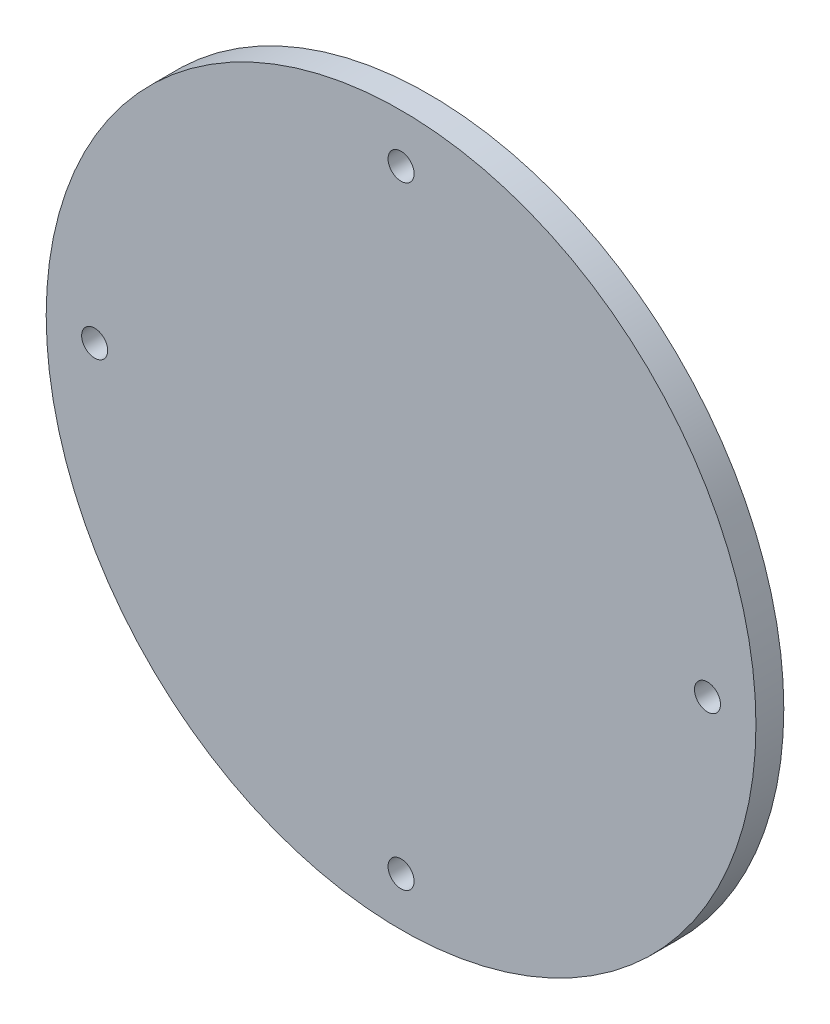
ISO-10303-21;
HEADER;
FILE_DESCRIPTION(('STEP AP214'),'2;1');
FILE_NAME('part.step','',(''),(''),'','','');
FILE_SCHEMA(('AUTOMOTIVE_DESIGN { 1 0 10303 214 1 1 1 1 }'));
ENDSEC;
DATA;
#1=APPLICATION_CONTEXT('core data for automotive mechanical design processes');
#2=APPLICATION_PROTOCOL_DEFINITION('international standard','automotive_design',2000,#1);
#3=PRODUCT_CONTEXT('',#1,'mechanical');
#4=PRODUCT('Part','Part','',(#3));
#5=PRODUCT_RELATED_PRODUCT_CATEGORY('part','',(#4));
#6=PRODUCT_DEFINITION_FORMATION('','',#4);
#7=PRODUCT_DEFINITION_CONTEXT('part definition',#1,'design');
#8=PRODUCT_DEFINITION('design','',#6,#7);
#9=PRODUCT_DEFINITION_SHAPE('','',#8);
#10=(LENGTH_UNIT() NAMED_UNIT(*) SI_UNIT(.MILLI.,.METRE.));
#11=(NAMED_UNIT(*) PLANE_ANGLE_UNIT() SI_UNIT($,.RADIAN.));
#12=(NAMED_UNIT(*) SI_UNIT($,.STERADIAN.) SOLID_ANGLE_UNIT());
#13=UNCERTAINTY_MEASURE_WITH_UNIT(LENGTH_MEASURE(1.E-05),#10,'distance_accuracy_value','');
#14=(GEOMETRIC_REPRESENTATION_CONTEXT(3) GLOBAL_UNCERTAINTY_ASSIGNED_CONTEXT((#13)) GLOBAL_UNIT_ASSIGNED_CONTEXT((#10,
#11,#12)) REPRESENTATION_CONTEXT('',''));
#15=CARTESIAN_POINT('',(0.,0.,0.));
#16=DIRECTION('',(0.,0.,1.));
#17=DIRECTION('',(1.,0.,0.));
#18=AXIS2_PLACEMENT_3D('',#15,#16,#17);
#19=CARTESIAN_POINT('',(0.,0.,5.));
#20=DIRECTION('',(0.,0.,1.));
#21=DIRECTION('',(1.,0.,0.));
#22=AXIS2_PLACEMENT_3D('',#19,#20,#21);
#23=PLANE('',#22);
#24=CARTESIAN_POINT('',(3.10618136515851E-12,-55.,5.));
#25=DIRECTION('',(0.,0.,1.));
#26=DIRECTION('',(1.,0.,0.));
#27=AXIS2_PLACEMENT_3D('',#24,#25,#26);
#28=CIRCLE('',#27,2.33568157311923);
#29=CARTESIAN_POINT('',(2.33568157312233,-55.,5.));
#30=VERTEX_POINT('',#29);
#31=EDGE_CURVE('E68',#30,#30,#28,.T.);
#32=ORIENTED_EDGE('',*,*,#31,.F.);
#33=EDGE_LOOP('',(#32));
#34=FACE_BOUND('',#33,.T.);
#35=CARTESIAN_POINT('',(0.,55.,5.));
#36=DIRECTION('',(0.,0.,1.));
#37=DIRECTION('',(1.,0.,0.));
#38=AXIS2_PLACEMENT_3D('',#35,#36,#37);
#39=CIRCLE('',#38,2.33568157311589);
#40=CARTESIAN_POINT('',(2.33568157311589,55.,5.));
#41=VERTEX_POINT('',#40);
#42=EDGE_CURVE('E54',#41,#41,#39,.T.);
#43=ORIENTED_EDGE('',*,*,#42,.F.);
#44=EDGE_LOOP('',(#43));
#45=FACE_BOUND('',#44,.T.);
#46=CARTESIAN_POINT('',(0.,0.,5.));
#47=DIRECTION('',(0.,0.,1.));
#48=DIRECTION('',(1.,0.,0.));
#49=AXIS2_PLACEMENT_3D('',#46,#47,#48);
#50=CIRCLE('',#49,63.7004065395242);
#51=CARTESIAN_POINT('',(63.7004065395242,0.,5.));
#52=VERTEX_POINT('',#51);
#53=EDGE_CURVE('E10',#52,#52,#50,.T.);
#54=ORIENTED_EDGE('',*,*,#53,.T.);
#55=EDGE_LOOP('',(#54));
#56=FACE_BOUND('',#55,.T.);
#57=CARTESIAN_POINT('',(55.0000000000016,1.55309068257925E-12,5.));
#58=DIRECTION('',(0.,0.,1.));
#59=DIRECTION('',(1.,0.,0.));
#60=AXIS2_PLACEMENT_3D('',#57,#58,#59);
#61=CIRCLE('',#60,2.3356815731171);
#62=CARTESIAN_POINT('',(57.3356815731187,1.55309068257925E-12,5.));
#63=VERTEX_POINT('',#62);
#64=EDGE_CURVE('E60',#63,#63,#61,.T.);
#65=ORIENTED_EDGE('',*,*,#64,.F.);
#66=EDGE_LOOP('',(#65));
#67=FACE_BOUND('',#66,.T.);
#68=CARTESIAN_POINT('',(-54.9999999999985,-1.55982623997457E-12,5.));
#69=DIRECTION('',(0.,0.,1.));
#70=DIRECTION('',(1.,0.,0.));
#71=AXIS2_PLACEMENT_3D('',#68,#69,#70);
#72=CIRCLE('',#71,2.33568157311839);
#73=CARTESIAN_POINT('',(-52.6643184268801,-1.55982623997457E-12,5.));
#74=VERTEX_POINT('',#73);
#75=EDGE_CURVE('E76',#74,#74,#72,.T.);
#76=ORIENTED_EDGE('',*,*,#75,.F.);
#77=EDGE_LOOP('',(#76));
#78=FACE_BOUND('',#77,.T.);
#79=ADVANCED_FACE('F41',(#34,#45,#56,#67,#78),#23,.T.);
#80=CARTESIAN_POINT('',(0.,0.,0.));
#81=DIRECTION('',(0.,0.,1.));
#82=DIRECTION('',(1.,0.,0.));
#83=AXIS2_PLACEMENT_3D('',#80,#81,#82);
#84=PLANE('',#83);
#85=CARTESIAN_POINT('',(0.,0.,0.));
#86=DIRECTION('',(0.,0.,1.));
#87=DIRECTION('',(1.,0.,0.));
#88=AXIS2_PLACEMENT_3D('',#85,#86,#87);
#89=CIRCLE('',#88,63.7004065395242);
#90=CARTESIAN_POINT('',(63.7004065395242,0.,0.));
#91=VERTEX_POINT('',#90);
#92=EDGE_CURVE('E45',#91,#91,#89,.T.);
#93=ORIENTED_EDGE('',*,*,#92,.F.);
#94=EDGE_LOOP('',(#93));
#95=FACE_BOUND('',#94,.T.);
#96=CARTESIAN_POINT('',(0.,55.,0.));
#97=DIRECTION('',(0.,0.,1.));
#98=DIRECTION('',(1.,0.,0.));
#99=AXIS2_PLACEMENT_3D('',#96,#97,#98);
#100=CIRCLE('',#99,2.33568157311589);
#101=CARTESIAN_POINT('',(2.33568157311589,55.,0.));
#102=VERTEX_POINT('',#101);
#103=EDGE_CURVE('E56',#102,#102,#100,.T.);
#104=ORIENTED_EDGE('',*,*,#103,.T.);
#105=EDGE_LOOP('',(#104));
#106=FACE_BOUND('',#105,.T.);
#107=CARTESIAN_POINT('',(55.0000000000016,1.55309068257925E-12,0.));
#108=DIRECTION('',(0.,0.,1.));
#109=DIRECTION('',(1.,0.,0.));
#110=AXIS2_PLACEMENT_3D('',#107,#108,#109);
#111=CIRCLE('',#110,2.3356815731171);
#112=CARTESIAN_POINT('',(57.3356815731187,1.55309068257925E-12,0.));
#113=VERTEX_POINT('',#112);
#114=EDGE_CURVE('E64',#113,#113,#111,.T.);
#115=ORIENTED_EDGE('',*,*,#114,.T.);
#116=EDGE_LOOP('',(#115));
#117=FACE_BOUND('',#116,.T.);
#118=CARTESIAN_POINT('',(3.10618136515851E-12,-55.,0.));
#119=DIRECTION('',(0.,0.,1.));
#120=DIRECTION('',(1.,0.,0.));
#121=AXIS2_PLACEMENT_3D('',#118,#119,#120);
#122=CIRCLE('',#121,2.33568157311923);
#123=CARTESIAN_POINT('',(2.33568157312233,-55.,0.));
#124=VERTEX_POINT('',#123);
#125=EDGE_CURVE('E72',#124,#124,#122,.T.);
#126=ORIENTED_EDGE('',*,*,#125,.T.);
#127=EDGE_LOOP('',(#126));
#128=FACE_BOUND('',#127,.T.);
#129=CARTESIAN_POINT('',(-54.9999999999985,-1.55982623997457E-12,0.));
#130=DIRECTION('',(0.,0.,1.));
#131=DIRECTION('',(1.,0.,0.));
#132=AXIS2_PLACEMENT_3D('',#129,#130,#131);
#133=CIRCLE('',#132,2.33568157311839);
#134=CARTESIAN_POINT('',(-52.6643184268801,-1.55982623997457E-12,0.));
#135=VERTEX_POINT('',#134);
#136=EDGE_CURVE('E80',#135,#135,#133,.T.);
#137=ORIENTED_EDGE('',*,*,#136,.T.);
#138=EDGE_LOOP('',(#137));
#139=FACE_BOUND('',#138,.T.);
#140=ADVANCED_FACE('F92',(#95,#106,#117,#128,#139),#84,.F.);
#141=CARTESIAN_POINT('',(0.,0.,5.));
#142=DIRECTION('',(0.,0.,-1.));
#143=DIRECTION('',(-1.,0.,0.));
#144=AXIS2_PLACEMENT_3D('',#141,#142,#143);
#145=CYLINDRICAL_SURFACE('',#144,63.7004065395242);
#146=ORIENTED_EDGE('',*,*,#53,.F.);
#147=EDGE_LOOP('',(#146));
#148=FACE_BOUND('',#147,.T.);
#149=ORIENTED_EDGE('',*,*,#92,.T.);
#150=EDGE_LOOP('',(#149));
#151=FACE_BOUND('',#150,.T.);
#152=ADVANCED_FACE('F43',(#148,#151),#145,.T.);
#153=CARTESIAN_POINT('',(0.,55.,5.));
#154=DIRECTION('',(0.,0.,-1.));
#155=DIRECTION('',(-1.,0.,0.));
#156=AXIS2_PLACEMENT_3D('',#153,#154,#155);
#157=CYLINDRICAL_SURFACE('',#156,2.33568157311589);
#158=ORIENTED_EDGE('',*,*,#42,.T.);
#159=EDGE_LOOP('',(#158));
#160=FACE_BOUND('',#159,.T.);
#161=ORIENTED_EDGE('',*,*,#103,.F.);
#162=EDGE_LOOP('',(#161));
#163=FACE_BOUND('',#162,.T.);
#164=ADVANCED_FACE('F102',(#160,#163),#157,.F.);
#165=CARTESIAN_POINT('',(55.0000000000016,1.55309068257925E-12,5.));
#166=DIRECTION('',(0.,0.,-1.));
#167=DIRECTION('',(-1.,0.,0.));
#168=AXIS2_PLACEMENT_3D('',#165,#166,#167);
#169=CYLINDRICAL_SURFACE('',#168,2.3356815731171);
#170=ORIENTED_EDGE('',*,*,#64,.T.);
#171=EDGE_LOOP('',(#170));
#172=FACE_BOUND('',#171,.T.);
#173=ORIENTED_EDGE('',*,*,#114,.F.);
#174=EDGE_LOOP('',(#173));
#175=FACE_BOUND('',#174,.T.);
#176=ADVANCED_FACE('F105',(#172,#175),#169,.F.);
#177=CARTESIAN_POINT('',(3.10618136515851E-12,-55.,5.));
#178=DIRECTION('',(0.,0.,-1.));
#179=DIRECTION('',(-1.,0.,0.));
#180=AXIS2_PLACEMENT_3D('',#177,#178,#179);
#181=CYLINDRICAL_SURFACE('',#180,2.33568157311923);
#182=ORIENTED_EDGE('',*,*,#31,.T.);
#183=EDGE_LOOP('',(#182));
#184=FACE_BOUND('',#183,.T.);
#185=ORIENTED_EDGE('',*,*,#125,.F.);
#186=EDGE_LOOP('',(#185));
#187=FACE_BOUND('',#186,.T.);
#188=ADVANCED_FACE('F109',(#184,#187),#181,.F.);
#189=CARTESIAN_POINT('',(-54.9999999999985,-1.55982623997457E-12,5.));
#190=DIRECTION('',(0.,0.,-1.));
#191=DIRECTION('',(-1.,0.,0.));
#192=AXIS2_PLACEMENT_3D('',#189,#190,#191);
#193=CYLINDRICAL_SURFACE('',#192,2.33568157311839);
#194=ORIENTED_EDGE('',*,*,#75,.T.);
#195=EDGE_LOOP('',(#194));
#196=FACE_BOUND('',#195,.T.);
#197=ORIENTED_EDGE('',*,*,#136,.F.);
#198=EDGE_LOOP('',(#197));
#199=FACE_BOUND('',#198,.T.);
#200=ADVANCED_FACE('F88',(#196,#199),#193,.F.);
#201=CLOSED_SHELL('',(#79,#140,#152,#164,#176,#188,#200));
#202=MANIFOLD_SOLID_BREP('B2',#201);
#203=ADVANCED_BREP_SHAPE_REPRESENTATION('',(#18,#202),#14);
#204=SHAPE_DEFINITION_REPRESENTATION(#9,#203);
ENDSEC;
END-ISO-10303-21;
